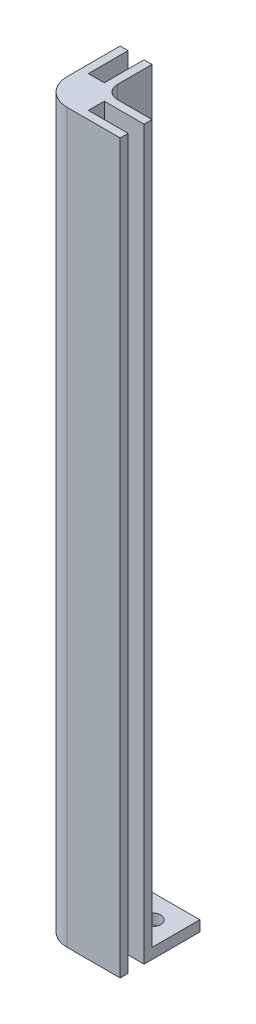
ISO-10303-21;
HEADER;
FILE_DESCRIPTION(('STEP AP214'),'2;1');
FILE_NAME('part.step','',(''),(''),'','','');
FILE_SCHEMA(('AUTOMOTIVE_DESIGN { 1 0 10303 214 1 1 1 1 }'));
ENDSEC;
DATA;
#1=APPLICATION_CONTEXT('core data for automotive mechanical design processes');
#2=APPLICATION_PROTOCOL_DEFINITION('international standard','automotive_design',2000,#1);
#3=PRODUCT_CONTEXT('',#1,'mechanical');
#4=PRODUCT('Part','Part','',(#3));
#5=PRODUCT_RELATED_PRODUCT_CATEGORY('part','',(#4));
#6=PRODUCT_DEFINITION_FORMATION('','',#4);
#7=PRODUCT_DEFINITION_CONTEXT('part definition',#1,'design');
#8=PRODUCT_DEFINITION('design','',#6,#7);
#9=PRODUCT_DEFINITION_SHAPE('','',#8);
#10=(LENGTH_UNIT() NAMED_UNIT(*) SI_UNIT(.MILLI.,.METRE.));
#11=(NAMED_UNIT(*) PLANE_ANGLE_UNIT() SI_UNIT($,.RADIAN.));
#12=(NAMED_UNIT(*) SI_UNIT($,.STERADIAN.) SOLID_ANGLE_UNIT());
#13=UNCERTAINTY_MEASURE_WITH_UNIT(LENGTH_MEASURE(1.E-05),#10,'distance_accuracy_value','');
#14=(GEOMETRIC_REPRESENTATION_CONTEXT(3) GLOBAL_UNCERTAINTY_ASSIGNED_CONTEXT((#13)) GLOBAL_UNIT_ASSIGNED_CONTEXT((#10,
#11,#12)) REPRESENTATION_CONTEXT('',''));
#15=CARTESIAN_POINT('',(0.,0.,0.));
#16=DIRECTION('',(0.,0.,1.));
#17=DIRECTION('',(1.,0.,0.));
#18=AXIS2_PLACEMENT_3D('',#15,#16,#17);
#19=CARTESIAN_POINT('',(-7.49999999999998,135.,7.50000000000001));
#20=DIRECTION('',(1.,0.,0.));
#21=DIRECTION('',(0.,0.,-1.));
#22=AXIS2_PLACEMENT_3D('',#19,#20,#21);
#23=PLANE('',#22);
#24=DIRECTION('',(0.,0.,-1.));
#25=VECTOR('',#24,1.);
#26=CARTESIAN_POINT('',(-7.49999999999999,-2.,0.));
#27=LINE('',#26,#25);
#28=CARTESIAN_POINT('',(-7.49999999999999,-2.,2.50000000000002));
#29=VERTEX_POINT('',#28);
#30=CARTESIAN_POINT('',(-7.50000000000001,-2.,-7.49999999999999));
#31=VERTEX_POINT('',#30);
#32=EDGE_CURVE('E160',#29,#31,#27,.T.);
#33=ORIENTED_EDGE('',*,*,#32,.F.);
#34=DIRECTION('',(0.,-1.,0.));
#35=VECTOR('',#34,1.);
#36=CARTESIAN_POINT('',(-7.49999999999999,135.,2.50000000000002));
#37=LINE('',#36,#35);
#38=CARTESIAN_POINT('',(-7.49999999999999,135.,2.50000000000002));
#39=VERTEX_POINT('',#38);
#40=EDGE_CURVE('E285',#29,#39,#37,.F.);
#41=ORIENTED_EDGE('',*,*,#40,.T.);
#42=DIRECTION('',(0.,0.,1.));
#43=VECTOR('',#42,1.);
#44=CARTESIAN_POINT('',(-7.49999999999998,135.,7.50000000000001));
#45=LINE('',#44,#43);
#46=CARTESIAN_POINT('',(-7.50000000000001,135.,-7.49999999999999));
#47=VERTEX_POINT('',#46);
#48=EDGE_CURVE('E178',#47,#39,#45,.T.);
#49=ORIENTED_EDGE('',*,*,#48,.F.);
#50=DIRECTION('',(0.,-1.,0.));
#51=VECTOR('',#50,1.);
#52=CARTESIAN_POINT('',(-7.50000000000001,135.,-7.49999999999999));
#53=LINE('',#52,#51);
#54=EDGE_CURVE('E176',#47,#31,#53,.T.);
#55=ORIENTED_EDGE('',*,*,#54,.T.);
#56=EDGE_LOOP('',(#33,#41,#49,#55));
#57=FACE_BOUND('',#56,.T.);
#58=ADVANCED_FACE('F42',(#57),#23,.F.);
#59=CARTESIAN_POINT('',(-7.49999999999998,135.,7.50000000000001));
#60=DIRECTION('',(0.,0.,-1.));
#61=DIRECTION('',(-1.,0.,0.));
#62=AXIS2_PLACEMENT_3D('',#59,#60,#61);
#63=PLANE('',#62);
#64=DIRECTION('',(1.,0.,0.));
#65=VECTOR('',#64,1.);
#66=CARTESIAN_POINT('',(-7.49999999999998,135.,7.50000000000001));
#67=LINE('',#66,#65);
#68=CARTESIAN_POINT('',(-2.49999999999999,135.,7.50000000000001));
#69=VERTEX_POINT('',#68);
#70=CARTESIAN_POINT('',(7.50000000000002,135.,7.50000000000001));
#71=VERTEX_POINT('',#70);
#72=EDGE_CURVE('E230',#69,#71,#67,.T.);
#73=ORIENTED_EDGE('',*,*,#72,.F.);
#74=DIRECTION('',(0.,-1.,0.));
#75=VECTOR('',#74,1.);
#76=CARTESIAN_POINT('',(-2.49999999999999,135.,7.50000000000001));
#77=LINE('',#76,#75);
#78=CARTESIAN_POINT('',(-2.49999999999999,-2.,7.50000000000001));
#79=VERTEX_POINT('',#78);
#80=EDGE_CURVE('E281',#69,#79,#77,.T.);
#81=ORIENTED_EDGE('',*,*,#80,.T.);
#82=DIRECTION('',(-1.,0.,0.));
#83=VECTOR('',#82,1.);
#84=CARTESIAN_POINT('',(0.,-2.,7.50000000000001));
#85=LINE('',#84,#83);
#86=CARTESIAN_POINT('',(7.50000000000002,-2.,7.50000000000001));
#87=VERTEX_POINT('',#86);
#88=EDGE_CURVE('E172',#87,#79,#85,.T.);
#89=ORIENTED_EDGE('',*,*,#88,.F.);
#90=DIRECTION('',(0.,-1.,0.));
#91=VECTOR('',#90,1.);
#92=CARTESIAN_POINT('',(7.50000000000002,135.,7.50000000000001));
#93=LINE('',#92,#91);
#94=EDGE_CURVE('E279',#71,#87,#93,.T.);
#95=ORIENTED_EDGE('',*,*,#94,.F.);
#96=EDGE_LOOP('',(#73,#81,#89,#95));
#97=FACE_BOUND('',#96,.T.);
#98=ADVANCED_FACE('F320',(#97),#63,.F.);
#99=CARTESIAN_POINT('',(7.50000000000002,135.,7.50000000000001));
#100=DIRECTION('',(-1.,0.,0.));
#101=DIRECTION('',(0.,0.,1.));
#102=AXIS2_PLACEMENT_3D('',#99,#100,#101);
#103=PLANE('',#102);
#104=ORIENTED_EDGE('',*,*,#94,.T.);
#105=DIRECTION('',(0.,0.,1.));
#106=VECTOR('',#105,1.);
#107=CARTESIAN_POINT('',(7.50000000000002,-2.,0.));
#108=LINE('',#107,#106);
#109=CARTESIAN_POINT('',(7.50000000000002,-2.,6.00000000000001));
#110=VERTEX_POINT('',#109);
#111=EDGE_CURVE('E211',#110,#87,#108,.T.);
#112=ORIENTED_EDGE('',*,*,#111,.F.);
#113=DIRECTION('',(0.,-1.,0.));
#114=VECTOR('',#113,1.);
#115=CARTESIAN_POINT('',(7.50000000000002,135.,6.00000000000001));
#116=LINE('',#115,#114);
#117=CARTESIAN_POINT('',(7.50000000000002,135.,6.00000000000001));
#118=VERTEX_POINT('',#117);
#119=EDGE_CURVE('E277',#118,#110,#116,.T.);
#120=ORIENTED_EDGE('',*,*,#119,.F.);
#121=DIRECTION('',(0.,0.,-1.));
#122=VECTOR('',#121,1.);
#123=CARTESIAN_POINT('',(7.50000000000002,135.,7.50000000000001));
#124=LINE('',#123,#122);
#125=EDGE_CURVE('E233',#71,#118,#124,.T.);
#126=ORIENTED_EDGE('',*,*,#125,.F.);
#127=EDGE_LOOP('',(#104,#112,#120,#126));
#128=FACE_BOUND('',#127,.T.);
#129=ADVANCED_FACE('F325',(#128),#103,.F.);
#130=CARTESIAN_POINT('',(7.50000000000002,135.,6.00000000000001));
#131=DIRECTION('',(0.,0.,1.));
#132=DIRECTION('',(1.,0.,0.));
#133=AXIS2_PLACEMENT_3D('',#130,#131,#132);
#134=PLANE('',#133);
#135=ORIENTED_EDGE('',*,*,#119,.T.);
#136=DIRECTION('',(1.,0.,0.));
#137=VECTOR('',#136,1.);
#138=CARTESIAN_POINT('',(0.,-2.,6.00000000000001));
#139=LINE('',#138,#137);
#140=CARTESIAN_POINT('',(0.,-2.,6.00000000000001));
#141=VERTEX_POINT('',#140);
#142=EDGE_CURVE('E208',#141,#110,#139,.T.);
#143=ORIENTED_EDGE('',*,*,#142,.F.);
#144=DIRECTION('',(0.,-1.,0.));
#145=VECTOR('',#144,1.);
#146=CARTESIAN_POINT('',(0.,135.,6.00000000000001));
#147=LINE('',#146,#145);
#148=CARTESIAN_POINT('',(0.,135.,6.00000000000001));
#149=VERTEX_POINT('',#148);
#150=EDGE_CURVE('E275',#149,#141,#147,.T.);
#151=ORIENTED_EDGE('',*,*,#150,.F.);
#152=DIRECTION('',(-1.,0.,0.));
#153=VECTOR('',#152,1.);
#154=CARTESIAN_POINT('',(7.50000000000002,135.,6.00000000000001));
#155=LINE('',#154,#153);
#156=EDGE_CURVE('E235',#118,#149,#155,.T.);
#157=ORIENTED_EDGE('',*,*,#156,.F.);
#158=EDGE_LOOP('',(#135,#143,#151,#157));
#159=FACE_BOUND('',#158,.T.);
#160=ADVANCED_FACE('F331',(#159),#134,.F.);
#161=CARTESIAN_POINT('',(0.,135.,6.00000000000001));
#162=DIRECTION('',(-1.,0.,0.));
#163=DIRECTION('',(0.,0.,1.));
#164=AXIS2_PLACEMENT_3D('',#161,#162,#163);
#165=PLANE('',#164);
#166=ORIENTED_EDGE('',*,*,#150,.T.);
#167=DIRECTION('',(0.,0.,1.));
#168=VECTOR('',#167,1.);
#169=CARTESIAN_POINT('',(0.,-2.,0.));
#170=LINE('',#169,#168);
#171=CARTESIAN_POINT('',(0.,-2.,3.));
#172=VERTEX_POINT('',#171);
#173=EDGE_CURVE('E205',#172,#141,#170,.T.);
#174=ORIENTED_EDGE('',*,*,#173,.F.);
#175=DIRECTION('',(0.,-1.,0.));
#176=VECTOR('',#175,1.);
#177=CARTESIAN_POINT('',(0.,135.,3.));
#178=LINE('',#177,#176);
#179=CARTESIAN_POINT('',(0.,135.,3.));
#180=VERTEX_POINT('',#179);
#181=EDGE_CURVE('E273',#180,#172,#178,.T.);
#182=ORIENTED_EDGE('',*,*,#181,.F.);
#183=DIRECTION('',(0.,0.,-1.));
#184=VECTOR('',#183,1.);
#185=CARTESIAN_POINT('',(0.,135.,6.00000000000001));
#186=LINE('',#185,#184);
#187=EDGE_CURVE('E237',#149,#180,#186,.T.);
#188=ORIENTED_EDGE('',*,*,#187,.F.);
#189=EDGE_LOOP('',(#166,#174,#182,#188));
#190=FACE_BOUND('',#189,.T.);
#191=ADVANCED_FACE('F335',(#190),#165,.F.);
#192=CARTESIAN_POINT('',(0.,135.,3.));
#193=DIRECTION('',(0.,0.,-1.));
#194=DIRECTION('',(-1.,0.,0.));
#195=AXIS2_PLACEMENT_3D('',#192,#193,#194);
#196=PLANE('',#195);
#197=ORIENTED_EDGE('',*,*,#181,.T.);
#198=DIRECTION('',(-1.,0.,0.));
#199=VECTOR('',#198,1.);
#200=CARTESIAN_POINT('',(0.,-2.,3.));
#201=LINE('',#200,#199);
#202=CARTESIAN_POINT('',(7.50000000000001,-2.,3.));
#203=VERTEX_POINT('',#202);
#204=EDGE_CURVE('E202',#203,#172,#201,.T.);
#205=ORIENTED_EDGE('',*,*,#204,.F.);
#206=DIRECTION('',(0.,-1.,0.));
#207=VECTOR('',#206,1.);
#208=CARTESIAN_POINT('',(7.50000000000001,135.,3.));
#209=LINE('',#208,#207);
#210=CARTESIAN_POINT('',(7.50000000000001,135.,3.));
#211=VERTEX_POINT('',#210);
#212=EDGE_CURVE('E271',#211,#203,#209,.T.);
#213=ORIENTED_EDGE('',*,*,#212,.F.);
#214=DIRECTION('',(1.,0.,0.));
#215=VECTOR('',#214,1.);
#216=CARTESIAN_POINT('',(0.,135.,3.));
#217=LINE('',#216,#215);
#218=EDGE_CURVE('E239',#180,#211,#217,.T.);
#219=ORIENTED_EDGE('',*,*,#218,.F.);
#220=EDGE_LOOP('',(#197,#205,#213,#219));
#221=FACE_BOUND('',#220,.T.);
#222=ADVANCED_FACE('F339',(#221),#196,.F.);
#223=CARTESIAN_POINT('',(7.50000000000001,135.,3.));
#224=DIRECTION('',(-1.,0.,0.));
#225=DIRECTION('',(0.,0.,1.));
#226=AXIS2_PLACEMENT_3D('',#223,#224,#225);
#227=PLANE('',#226);
#228=ORIENTED_EDGE('',*,*,#212,.T.);
#229=DIRECTION('',(0.,0.,1.));
#230=VECTOR('',#229,1.);
#231=CARTESIAN_POINT('',(7.50000000000001,-2.,0.));
#232=LINE('',#231,#230);
#233=CARTESIAN_POINT('',(7.50000000000001,-2.,-7.49999999999999));
#234=VERTEX_POINT('',#233);
#235=EDGE_CURVE('E199',#234,#203,#232,.T.);
#236=ORIENTED_EDGE('',*,*,#235,.F.);
#237=DIRECTION('',(0.,1.,0.));
#238=VECTOR('',#237,1.);
#239=CARTESIAN_POINT('',(7.50000000000001,-2.,-7.49999999999999));
#240=LINE('',#239,#238);
#241=CARTESIAN_POINT('',(7.50000000000001,0.,-7.49999999999999));
#242=VERTEX_POINT('',#241);
#243=EDGE_CURVE('E217',#234,#242,#240,.T.);
#244=ORIENTED_EDGE('',*,*,#243,.T.);
#245=DIRECTION('',(0.,0.,1.));
#246=VECTOR('',#245,1.);
#247=CARTESIAN_POINT('',(7.50000000000001,0.,0.));
#248=LINE('',#247,#246);
#249=CARTESIAN_POINT('',(7.50000000000001,0.,1.5));
#250=VERTEX_POINT('',#249);
#251=EDGE_CURVE('E220',#242,#250,#248,.T.);
#252=ORIENTED_EDGE('',*,*,#251,.T.);
#253=DIRECTION('',(0.,-1.,0.));
#254=VECTOR('',#253,1.);
#255=CARTESIAN_POINT('',(7.50000000000001,135.,1.5));
#256=LINE('',#255,#254);
#257=CARTESIAN_POINT('',(7.50000000000001,135.,1.5));
#258=VERTEX_POINT('',#257);
#259=EDGE_CURVE('E268',#258,#250,#256,.T.);
#260=ORIENTED_EDGE('',*,*,#259,.F.);
#261=DIRECTION('',(0.,0.,-1.));
#262=VECTOR('',#261,1.);
#263=CARTESIAN_POINT('',(7.50000000000001,135.,3.));
#264=LINE('',#263,#262);
#265=EDGE_CURVE('E241',#211,#258,#264,.T.);
#266=ORIENTED_EDGE('',*,*,#265,.F.);
#267=EDGE_LOOP('',(#228,#236,#244,#252,#260,#266));
#268=FACE_BOUND('',#267,.T.);
#269=ADVANCED_FACE('F343',(#268),#227,.F.);
#270=CARTESIAN_POINT('',(7.50000000000001,135.,1.5));
#271=DIRECTION('',(0.,0.,1.));
#272=DIRECTION('',(1.,0.,0.));
#273=AXIS2_PLACEMENT_3D('',#270,#271,#272);
#274=PLANE('',#273);
#275=DIRECTION('',(-1.,0.,0.));
#276=VECTOR('',#275,1.);
#277=CARTESIAN_POINT('',(7.50000000000001,0.,1.5));
#278=LINE('',#277,#276);
#279=CARTESIAN_POINT('',(1.00000000000001,0.,1.5));
#280=VERTEX_POINT('',#279);
#281=EDGE_CURVE('E228',#250,#280,#278,.T.);
#282=ORIENTED_EDGE('',*,*,#281,.T.);
#283=DIRECTION('',(0.,-1.,0.));
#284=VECTOR('',#283,1.);
#285=CARTESIAN_POINT('',(1.00000000000001,135.,1.5));
#286=LINE('',#285,#284);
#287=CARTESIAN_POINT('',(1.00000000000001,135.,1.5));
#288=VERTEX_POINT('',#287);
#289=EDGE_CURVE('E50',#280,#288,#286,.F.);
#290=ORIENTED_EDGE('',*,*,#289,.T.);
#291=DIRECTION('',(-1.,0.,0.));
#292=VECTOR('',#291,1.);
#293=CARTESIAN_POINT('',(7.50000000000001,135.,1.5));
#294=LINE('',#293,#292);
#295=EDGE_CURVE('E243',#258,#288,#294,.T.);
#296=ORIENTED_EDGE('',*,*,#295,.F.);
#297=ORIENTED_EDGE('',*,*,#259,.T.);
#298=EDGE_LOOP('',(#282,#290,#296,#297));
#299=FACE_BOUND('',#298,.T.);
#300=ADVANCED_FACE('F347',(#299),#274,.F.);
#301=CARTESIAN_POINT('',(-1.5,135.,-7.49999999999999));
#302=DIRECTION('',(-1.,0.,0.));
#303=DIRECTION('',(0.,0.,1.));
#304=AXIS2_PLACEMENT_3D('',#301,#302,#303);
#305=PLANE('',#304);
#306=DIRECTION('',(0.,0.,-1.));
#307=VECTOR('',#306,1.);
#308=CARTESIAN_POINT('',(-1.5,135.,-7.49999999999999));
#309=LINE('',#308,#307);
#310=CARTESIAN_POINT('',(-1.49999999999999,135.,-0.999999999999996));
#311=VERTEX_POINT('',#310);
#312=CARTESIAN_POINT('',(-1.5,135.,-7.49999999999999));
#313=VERTEX_POINT('',#312);
#314=EDGE_CURVE('E245',#311,#313,#309,.T.);
#315=ORIENTED_EDGE('',*,*,#314,.F.);
#316=DIRECTION('',(0.,-1.,0.));
#317=VECTOR('',#316,1.);
#318=CARTESIAN_POINT('',(-1.49999999999999,0.,-0.999999999999995));
#319=LINE('',#318,#317);
#320=CARTESIAN_POINT('',(-1.49999999999999,0.,-0.999999999999996));
#321=VERTEX_POINT('',#320);
#322=EDGE_CURVE('E289',#311,#321,#319,.T.);
#323=ORIENTED_EDGE('',*,*,#322,.T.);
#324=DIRECTION('',(0.,0.,-1.));
#325=VECTOR('',#324,1.);
#326=CARTESIAN_POINT('',(-1.5,0.,-7.49999999999999));
#327=LINE('',#326,#325);
#328=CARTESIAN_POINT('',(-1.49999999999999,0.,-7.49999999999999));
#329=VERTEX_POINT('',#328);
#330=EDGE_CURVE('E231',#321,#329,#327,.T.);
#331=ORIENTED_EDGE('',*,*,#330,.T.);
#332=DIRECTION('',(0.,-1.,0.));
#333=VECTOR('',#332,1.);
#334=CARTESIAN_POINT('',(-1.5,135.,-7.49999999999999));
#335=LINE('',#334,#333);
#336=EDGE_CURVE('E265',#313,#329,#335,.T.);
#337=ORIENTED_EDGE('',*,*,#336,.F.);
#338=EDGE_LOOP('',(#315,#323,#331,#337));
#339=FACE_BOUND('',#338,.T.);
#340=ADVANCED_FACE('F295',(#339),#305,.F.);
#341=CARTESIAN_POINT('',(-2.99999999999999,135.,-7.49999999999999));
#342=DIRECTION('',(0.,0.,1.));
#343=DIRECTION('',(1.,0.,0.));
#344=AXIS2_PLACEMENT_3D('',#341,#342,#343);
#345=PLANE('',#344);
#346=ORIENTED_EDGE('',*,*,#336,.T.);
#347=DIRECTION('',(1.,0.,0.));
#348=VECTOR('',#347,1.);
#349=CARTESIAN_POINT('',(0.,0.,-7.49999999999999));
#350=LINE('',#349,#348);
#351=EDGE_CURVE('E218',#329,#242,#350,.T.);
#352=ORIENTED_EDGE('',*,*,#351,.T.);
#353=ORIENTED_EDGE('',*,*,#243,.F.);
#354=DIRECTION('',(1.,0.,0.));
#355=VECTOR('',#354,1.);
#356=CARTESIAN_POINT('',(0.,-2.,-7.49999999999999));
#357=LINE('',#356,#355);
#358=CARTESIAN_POINT('',(-2.99999999999999,-2.,-7.49999999999999));
#359=VERTEX_POINT('',#358);
#360=EDGE_CURVE('E197',#359,#234,#357,.T.);
#361=ORIENTED_EDGE('',*,*,#360,.F.);
#362=DIRECTION('',(0.,-1.,0.));
#363=VECTOR('',#362,1.);
#364=CARTESIAN_POINT('',(-2.99999999999999,135.,-7.49999999999999));
#365=LINE('',#364,#363);
#366=CARTESIAN_POINT('',(-2.99999999999999,135.,-7.49999999999999));
#367=VERTEX_POINT('',#366);
#368=EDGE_CURVE('E263',#367,#359,#365,.T.);
#369=ORIENTED_EDGE('',*,*,#368,.F.);
#370=DIRECTION('',(-1.,0.,0.));
#371=VECTOR('',#370,1.);
#372=CARTESIAN_POINT('',(-2.99999999999999,135.,-7.49999999999999));
#373=LINE('',#372,#371);
#374=EDGE_CURVE('E247',#313,#367,#373,.T.);
#375=ORIENTED_EDGE('',*,*,#374,.F.);
#376=EDGE_LOOP('',(#346,#352,#353,#361,#369,#375));
#377=FACE_BOUND('',#376,.T.);
#378=ADVANCED_FACE('F306',(#377),#345,.F.);
#379=CARTESIAN_POINT('',(-2.99999999999999,135.,0.));
#380=DIRECTION('',(1.,0.,0.));
#381=DIRECTION('',(0.,0.,-1.));
#382=AXIS2_PLACEMENT_3D('',#379,#380,#381);
#383=PLANE('',#382);
#384=ORIENTED_EDGE('',*,*,#368,.T.);
#385=DIRECTION('',(0.,0.,-1.));
#386=VECTOR('',#385,1.);
#387=CARTESIAN_POINT('',(-2.99999999999999,-2.,0.));
#388=LINE('',#387,#386);
#389=CARTESIAN_POINT('',(-2.99999999999999,-2.,0.));
#390=VERTEX_POINT('',#389);
#391=EDGE_CURVE('E194',#390,#359,#388,.T.);
#392=ORIENTED_EDGE('',*,*,#391,.F.);
#393=DIRECTION('',(0.,-1.,0.));
#394=VECTOR('',#393,1.);
#395=CARTESIAN_POINT('',(-2.99999999999999,135.,0.));
#396=LINE('',#395,#394);
#397=CARTESIAN_POINT('',(-2.99999999999999,135.,0.));
#398=VERTEX_POINT('',#397);
#399=EDGE_CURVE('E261',#398,#390,#396,.T.);
#400=ORIENTED_EDGE('',*,*,#399,.F.);
#401=DIRECTION('',(0.,0.,1.));
#402=VECTOR('',#401,1.);
#403=CARTESIAN_POINT('',(-2.99999999999999,135.,0.));
#404=LINE('',#403,#402);
#405=EDGE_CURVE('E249',#367,#398,#404,.T.);
#406=ORIENTED_EDGE('',*,*,#405,.F.);
#407=EDGE_LOOP('',(#384,#392,#400,#406));
#408=FACE_BOUND('',#407,.T.);
#409=ADVANCED_FACE('F355',(#408),#383,.F.);
#410=CARTESIAN_POINT('',(-6.00000000000001,135.,0.));
#411=DIRECTION('',(0.,0.,1.));
#412=DIRECTION('',(1.,0.,0.));
#413=AXIS2_PLACEMENT_3D('',#410,#411,#412);
#414=PLANE('',#413);
#415=ORIENTED_EDGE('',*,*,#399,.T.);
#416=DIRECTION('',(1.,0.,0.));
#417=VECTOR('',#416,1.);
#418=CARTESIAN_POINT('',(0.,-2.,0.));
#419=LINE('',#418,#417);
#420=CARTESIAN_POINT('',(-6.00000000000001,-2.,0.));
#421=VERTEX_POINT('',#420);
#422=EDGE_CURVE('E188',#421,#390,#419,.T.);
#423=ORIENTED_EDGE('',*,*,#422,.F.);
#424=DIRECTION('',(0.,-1.,0.));
#425=VECTOR('',#424,1.);
#426=CARTESIAN_POINT('',(-6.00000000000001,135.,0.));
#427=LINE('',#426,#425);
#428=CARTESIAN_POINT('',(-6.00000000000001,135.,0.));
#429=VERTEX_POINT('',#428);
#430=EDGE_CURVE('E259',#429,#421,#427,.T.);
#431=ORIENTED_EDGE('',*,*,#430,.F.);
#432=DIRECTION('',(-1.,0.,0.));
#433=VECTOR('',#432,1.);
#434=CARTESIAN_POINT('',(-6.00000000000001,135.,0.));
#435=LINE('',#434,#433);
#436=EDGE_CURVE('E251',#398,#429,#435,.T.);
#437=ORIENTED_EDGE('',*,*,#436,.F.);
#438=EDGE_LOOP('',(#415,#423,#431,#437));
#439=FACE_BOUND('',#438,.T.);
#440=ADVANCED_FACE('F358',(#439),#414,.F.);
#441=CARTESIAN_POINT('',(-6.00000000000001,135.,-7.49999999999999));
#442=DIRECTION('',(-1.,0.,0.));
#443=DIRECTION('',(0.,0.,1.));
#444=AXIS2_PLACEMENT_3D('',#441,#442,#443);
#445=PLANE('',#444);
#446=ORIENTED_EDGE('',*,*,#430,.T.);
#447=DIRECTION('',(0.,0.,1.));
#448=VECTOR('',#447,1.);
#449=CARTESIAN_POINT('',(-6.00000000000001,-2.,0.));
#450=LINE('',#449,#448);
#451=CARTESIAN_POINT('',(-6.00000000000001,-2.,-7.49999999999999));
#452=VERTEX_POINT('',#451);
#453=EDGE_CURVE('E186',#452,#421,#450,.T.);
#454=ORIENTED_EDGE('',*,*,#453,.F.);
#455=DIRECTION('',(0.,-1.,0.));
#456=VECTOR('',#455,1.);
#457=CARTESIAN_POINT('',(-6.00000000000001,135.,-7.49999999999999));
#458=LINE('',#457,#456);
#459=CARTESIAN_POINT('',(-6.00000000000001,135.,-7.49999999999999));
#460=VERTEX_POINT('',#459);
#461=EDGE_CURVE('E181',#460,#452,#458,.T.);
#462=ORIENTED_EDGE('',*,*,#461,.F.);
#463=DIRECTION('',(0.,0.,-1.));
#464=VECTOR('',#463,1.);
#465=CARTESIAN_POINT('',(-6.00000000000001,135.,-7.49999999999999));
#466=LINE('',#465,#464);
#467=EDGE_CURVE('E253',#429,#460,#466,.T.);
#468=ORIENTED_EDGE('',*,*,#467,.F.);
#469=EDGE_LOOP('',(#446,#454,#462,#468));
#470=FACE_BOUND('',#469,.T.);
#471=ADVANCED_FACE('F362',(#470),#445,.F.);
#472=CARTESIAN_POINT('',(-7.50000000000001,135.,-7.49999999999999));
#473=DIRECTION('',(0.,0.,1.));
#474=DIRECTION('',(1.,0.,0.));
#475=AXIS2_PLACEMENT_3D('',#472,#473,#474);
#476=PLANE('',#475);
#477=ORIENTED_EDGE('',*,*,#461,.T.);
#478=DIRECTION('',(1.,0.,0.));
#479=VECTOR('',#478,1.);
#480=CARTESIAN_POINT('',(0.,-2.,-7.49999999999999));
#481=LINE('',#480,#479);
#482=EDGE_CURVE('E167',#31,#452,#481,.T.);
#483=ORIENTED_EDGE('',*,*,#482,.F.);
#484=ORIENTED_EDGE('',*,*,#54,.F.);
#485=DIRECTION('',(-1.,0.,0.));
#486=VECTOR('',#485,1.);
#487=CARTESIAN_POINT('',(-7.50000000000001,135.,-7.49999999999999));
#488=LINE('',#487,#486);
#489=EDGE_CURVE('E182',#460,#47,#488,.T.);
#490=ORIENTED_EDGE('',*,*,#489,.F.);
#491=EDGE_LOOP('',(#477,#483,#484,#490));
#492=FACE_BOUND('',#491,.T.);
#493=ADVANCED_FACE('F184',(#492),#476,.F.);
#494=CARTESIAN_POINT('',(0.,135.,0.));
#495=DIRECTION('',(0.,-1.,0.));
#496=DIRECTION('',(0.,0.,-1.));
#497=AXIS2_PLACEMENT_3D('',#494,#495,#496);
#498=PLANE('',#497);
#499=ORIENTED_EDGE('',*,*,#48,.T.);
#500=CARTESIAN_POINT('',(-2.49999999999999,135.,2.50000000000001));
#501=DIRECTION('',(0.,-1.,0.));
#502=DIRECTION('',(0.,0.,-1.));
#503=AXIS2_PLACEMENT_3D('',#500,#501,#502);
#504=CIRCLE('',#503,5.);
#505=EDGE_CURVE('E287',#39,#69,#504,.F.);
#506=ORIENTED_EDGE('',*,*,#505,.T.);
#507=ORIENTED_EDGE('',*,*,#72,.T.);
#508=ORIENTED_EDGE('',*,*,#125,.T.);
#509=ORIENTED_EDGE('',*,*,#156,.T.);
#510=ORIENTED_EDGE('',*,*,#187,.T.);
#511=ORIENTED_EDGE('',*,*,#218,.T.);
#512=ORIENTED_EDGE('',*,*,#265,.T.);
#513=ORIENTED_EDGE('',*,*,#295,.T.);
#514=CARTESIAN_POINT('',(1.00000000000001,135.,-0.999999999999999));
#515=DIRECTION('',(0.,-1.,0.));
#516=DIRECTION('',(0.,0.,-1.));
#517=AXIS2_PLACEMENT_3D('',#514,#515,#516);
#518=CIRCLE('',#517,2.5);
#519=EDGE_CURVE('E11',#288,#311,#518,.T.);
#520=ORIENTED_EDGE('',*,*,#519,.T.);
#521=ORIENTED_EDGE('',*,*,#314,.T.);
#522=ORIENTED_EDGE('',*,*,#374,.T.);
#523=ORIENTED_EDGE('',*,*,#405,.T.);
#524=ORIENTED_EDGE('',*,*,#436,.T.);
#525=ORIENTED_EDGE('',*,*,#467,.T.);
#526=ORIENTED_EDGE('',*,*,#489,.T.);
#527=EDGE_LOOP('',(#499,#506,#507,#508,#509,#510,#511,#512,#513,#520,#521,#522,#523,#524,#525,#526));
#528=FACE_BOUND('',#527,.T.);
#529=ADVANCED_FACE('F311',(#528),#498,.F.);
#530=CARTESIAN_POINT('',(3.00000000000001,-2.,-3.));
#531=DIRECTION('',(0.,1.,0.));
#532=DIRECTION('',(0.,0.,1.));
#533=AXIS2_PLACEMENT_3D('',#530,#531,#532);
#534=CYLINDRICAL_SURFACE('',#533,1.6);
#535=CARTESIAN_POINT('',(3.00000000000001,-2.,-3.));
#536=DIRECTION('',(0.,-1.,0.));
#537=DIRECTION('',(0.,0.,-1.));
#538=AXIS2_PLACEMENT_3D('',#535,#536,#537);
#539=CIRCLE('',#538,1.6);
#540=CARTESIAN_POINT('',(3.00000000000001,-2.,-4.6));
#541=VERTEX_POINT('',#540);
#542=EDGE_CURVE('E214',#541,#541,#539,.T.);
#543=ORIENTED_EDGE('',*,*,#542,.T.);
#544=EDGE_LOOP('',(#543));
#545=FACE_BOUND('',#544,.T.);
#546=CARTESIAN_POINT('',(3.00000000000001,0.,-3.));
#547=DIRECTION('',(0.,-1.,0.));
#548=DIRECTION('',(0.,0.,-1.));
#549=AXIS2_PLACEMENT_3D('',#546,#547,#548);
#550=CIRCLE('',#549,1.6);
#551=CARTESIAN_POINT('',(3.00000000000001,0.,-4.6));
#552=VERTEX_POINT('',#551);
#553=EDGE_CURVE('E223',#552,#552,#550,.T.);
#554=ORIENTED_EDGE('',*,*,#553,.F.);
#555=EDGE_LOOP('',(#554));
#556=FACE_BOUND('',#555,.T.);
#557=ADVANCED_FACE('F371',(#545,#556),#534,.F.);
#558=CARTESIAN_POINT('',(0.,-2.,0.));
#559=DIRECTION('',(0.,-1.,0.));
#560=DIRECTION('',(0.,0.,-1.));
#561=AXIS2_PLACEMENT_3D('',#558,#559,#560);
#562=PLANE('',#561);
#563=ORIENTED_EDGE('',*,*,#88,.T.);
#564=CARTESIAN_POINT('',(-2.49999999999999,-2.,2.50000000000001));
#565=DIRECTION('',(0.,-1.,0.));
#566=DIRECTION('',(0.,0.,-1.));
#567=AXIS2_PLACEMENT_3D('',#564,#565,#566);
#568=CIRCLE('',#567,5.);
#569=EDGE_CURVE('E169',#79,#29,#568,.T.);
#570=ORIENTED_EDGE('',*,*,#569,.T.);
#571=ORIENTED_EDGE('',*,*,#32,.T.);
#572=ORIENTED_EDGE('',*,*,#482,.T.);
#573=ORIENTED_EDGE('',*,*,#453,.T.);
#574=ORIENTED_EDGE('',*,*,#422,.T.);
#575=ORIENTED_EDGE('',*,*,#391,.T.);
#576=ORIENTED_EDGE('',*,*,#360,.T.);
#577=ORIENTED_EDGE('',*,*,#235,.T.);
#578=ORIENTED_EDGE('',*,*,#204,.T.);
#579=ORIENTED_EDGE('',*,*,#173,.T.);
#580=ORIENTED_EDGE('',*,*,#142,.T.);
#581=ORIENTED_EDGE('',*,*,#111,.T.);
#582=EDGE_LOOP('',(#563,#570,#571,#572,#573,#574,#575,#576,#577,#578,#579,#580,#581));
#583=FACE_BOUND('',#582,.T.);
#584=ORIENTED_EDGE('',*,*,#542,.F.);
#585=EDGE_LOOP('',(#584));
#586=FACE_BOUND('',#585,.T.);
#587=ADVANCED_FACE('F163',(#583,#586),#562,.T.);
#588=CARTESIAN_POINT('',(0.,0.,0.));
#589=DIRECTION('',(0.,-1.,0.));
#590=DIRECTION('',(0.,0.,-1.));
#591=AXIS2_PLACEMENT_3D('',#588,#589,#590);
#592=PLANE('',#591);
#593=ORIENTED_EDGE('',*,*,#330,.F.);
#594=CARTESIAN_POINT('',(1.00000000000001,0.,-0.999999999999999));
#595=DIRECTION('',(0.,-1.,0.));
#596=DIRECTION('',(0.,0.,-1.));
#597=AXIS2_PLACEMENT_3D('',#594,#595,#596);
#598=CIRCLE('',#597,2.5);
#599=EDGE_CURVE('E64',#321,#280,#598,.F.);
#600=ORIENTED_EDGE('',*,*,#599,.T.);
#601=ORIENTED_EDGE('',*,*,#281,.F.);
#602=ORIENTED_EDGE('',*,*,#251,.F.);
#603=ORIENTED_EDGE('',*,*,#351,.F.);
#604=EDGE_LOOP('',(#593,#600,#601,#602,#603));
#605=FACE_BOUND('',#604,.T.);
#606=ORIENTED_EDGE('',*,*,#553,.T.);
#607=EDGE_LOOP('',(#606));
#608=FACE_BOUND('',#607,.T.);
#609=ADVANCED_FACE('F300',(#605,#608),#592,.F.);
#610=CARTESIAN_POINT('',(-2.49999999999999,135.,2.50000000000001));
#611=DIRECTION('',(0.,-1.,0.));
#612=DIRECTION('',(0.,0.,-1.));
#613=AXIS2_PLACEMENT_3D('',#610,#611,#612);
#614=CYLINDRICAL_SURFACE('',#613,5.);
#615=ORIENTED_EDGE('',*,*,#505,.F.);
#616=ORIENTED_EDGE('',*,*,#40,.F.);
#617=ORIENTED_EDGE('',*,*,#569,.F.);
#618=ORIENTED_EDGE('',*,*,#80,.F.);
#619=EDGE_LOOP('',(#615,#616,#617,#618));
#620=FACE_BOUND('',#619,.T.);
#621=ADVANCED_FACE('F314',(#620),#614,.T.);
#622=CARTESIAN_POINT('',(1.00000000000001,135.,-0.999999999999999));
#623=DIRECTION('',(0.,1.,0.));
#624=DIRECTION('',(0.,0.,1.));
#625=AXIS2_PLACEMENT_3D('',#622,#623,#624);
#626=CYLINDRICAL_SURFACE('',#625,2.5);
#627=ORIENTED_EDGE('',*,*,#519,.F.);
#628=ORIENTED_EDGE('',*,*,#289,.F.);
#629=ORIENTED_EDGE('',*,*,#599,.F.);
#630=ORIENTED_EDGE('',*,*,#322,.F.);
#631=EDGE_LOOP('',(#627,#628,#629,#630));
#632=FACE_BOUND('',#631,.T.);
#633=ADVANCED_FACE('F44',(#632),#626,.F.);
#634=CLOSED_SHELL('',(#58,#98,#129,#160,#191,#222,#269,#300,#340,#378,#409,#440,#471,#493,#529,
#557,#587,#609,#621,#633));
#635=MANIFOLD_SOLID_BREP('B2',#634);
#636=ADVANCED_BREP_SHAPE_REPRESENTATION('',(#18,#635),#14);
#637=SHAPE_DEFINITION_REPRESENTATION(#9,#636);
ENDSEC;
END-ISO-10303-21;
